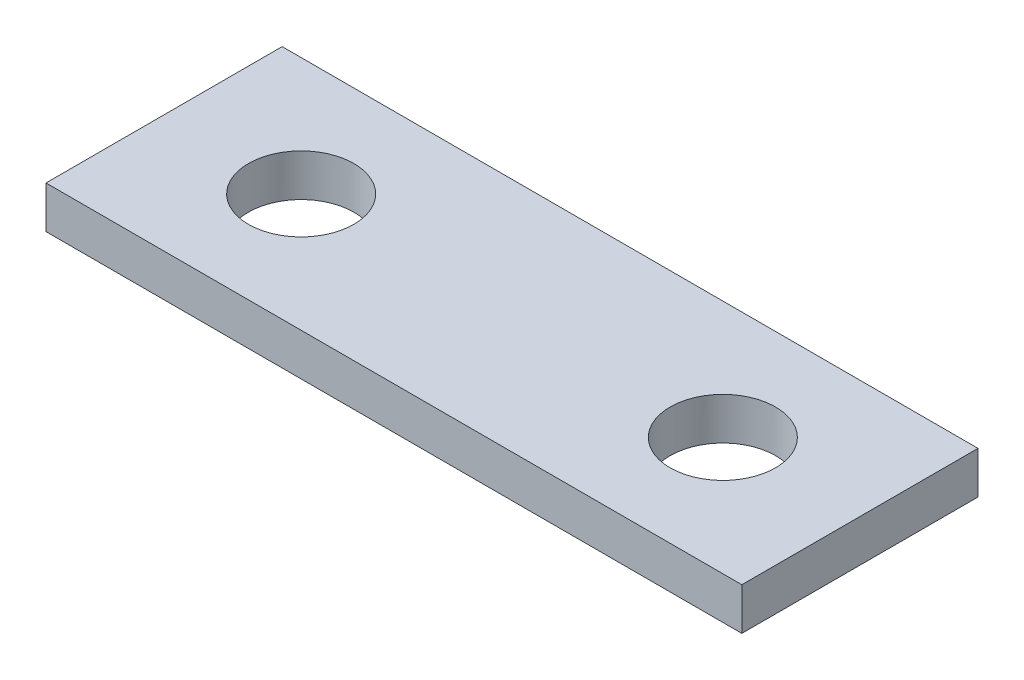
ISO-10303-21;
HEADER;
FILE_DESCRIPTION(('STEP AP214'),'2;1');
FILE_NAME('part.step','',(''),(''),'','','');
FILE_SCHEMA(('AUTOMOTIVE_DESIGN { 1 0 10303 214 1 1 1 1 }'));
ENDSEC;
DATA;
#1=APPLICATION_CONTEXT('core data for automotive mechanical design processes');
#2=APPLICATION_PROTOCOL_DEFINITION('international standard','automotive_design',2000,#1);
#3=PRODUCT_CONTEXT('',#1,'mechanical');
#4=PRODUCT('Part','Part','',(#3));
#5=PRODUCT_RELATED_PRODUCT_CATEGORY('part','',(#4));
#6=PRODUCT_DEFINITION_FORMATION('','',#4);
#7=PRODUCT_DEFINITION_CONTEXT('part definition',#1,'design');
#8=PRODUCT_DEFINITION('design','',#6,#7);
#9=PRODUCT_DEFINITION_SHAPE('','',#8);
#10=(LENGTH_UNIT() NAMED_UNIT(*) SI_UNIT(.MILLI.,.METRE.));
#11=(NAMED_UNIT(*) PLANE_ANGLE_UNIT() SI_UNIT($,.RADIAN.));
#12=(NAMED_UNIT(*) SI_UNIT($,.STERADIAN.) SOLID_ANGLE_UNIT());
#13=UNCERTAINTY_MEASURE_WITH_UNIT(LENGTH_MEASURE(1.E-05),#10,'distance_accuracy_value','');
#14=(GEOMETRIC_REPRESENTATION_CONTEXT(3) GLOBAL_UNCERTAINTY_ASSIGNED_CONTEXT((#13)) GLOBAL_UNIT_ASSIGNED_CONTEXT((#10,
#11,#12)) REPRESENTATION_CONTEXT('',''));
#15=CARTESIAN_POINT('',(0.,0.,0.));
#16=DIRECTION('',(0.,0.,1.));
#17=DIRECTION('',(1.,0.,0.));
#18=AXIS2_PLACEMENT_3D('',#15,#16,#17);
#19=CARTESIAN_POINT('',(0.,1.,0.));
#20=DIRECTION('',(1.,0.,0.));
#21=DIRECTION('',(0.,0.,-1.));
#22=AXIS2_PLACEMENT_3D('',#19,#20,#21);
#23=PLANE('',#22);
#24=DIRECTION('',(0.,0.,1.));
#25=VECTOR('',#24,1.);
#26=CARTESIAN_POINT('',(0.,0.,0.));
#27=LINE('',#26,#25);
#28=CARTESIAN_POINT('',(0.,0.,-5.6));
#29=VERTEX_POINT('',#28);
#30=CARTESIAN_POINT('',(0.,0.,0.));
#31=VERTEX_POINT('',#30);
#32=EDGE_CURVE('E98',#29,#31,#27,.T.);
#33=ORIENTED_EDGE('',*,*,#32,.T.);
#34=DIRECTION('',(0.,-1.,0.));
#35=VECTOR('',#34,1.);
#36=CARTESIAN_POINT('',(0.,1.,0.));
#37=LINE('',#36,#35);
#38=CARTESIAN_POINT('',(0.,1.,0.));
#39=VERTEX_POINT('',#38);
#40=EDGE_CURVE('E11',#39,#31,#37,.T.);
#41=ORIENTED_EDGE('',*,*,#40,.F.);
#42=DIRECTION('',(0.,0.,1.));
#43=VECTOR('',#42,1.);
#44=CARTESIAN_POINT('',(0.,1.,0.));
#45=LINE('',#44,#43);
#46=CARTESIAN_POINT('',(0.,1.,-5.6));
#47=VERTEX_POINT('',#46);
#48=EDGE_CURVE('E86',#47,#39,#45,.T.);
#49=ORIENTED_EDGE('',*,*,#48,.F.);
#50=DIRECTION('',(0.,-1.,0.));
#51=VECTOR('',#50,1.);
#52=CARTESIAN_POINT('',(0.,1.,-5.6));
#53=LINE('',#52,#51);
#54=EDGE_CURVE('E94',#47,#29,#53,.T.);
#55=ORIENTED_EDGE('',*,*,#54,.T.);
#56=EDGE_LOOP('',(#33,#41,#49,#55));
#57=FACE_BOUND('',#56,.T.);
#58=ADVANCED_FACE('F35',(#57),#23,.F.);
#59=CARTESIAN_POINT('',(0.,1.,0.));
#60=DIRECTION('',(0.,0.,-1.));
#61=DIRECTION('',(-1.,0.,0.));
#62=AXIS2_PLACEMENT_3D('',#59,#60,#61);
#63=PLANE('',#62);
#64=DIRECTION('',(1.,0.,0.));
#65=VECTOR('',#64,1.);
#66=CARTESIAN_POINT('',(0.,0.,0.));
#67=LINE('',#66,#65);
#68=CARTESIAN_POINT('',(16.5,0.,0.));
#69=VERTEX_POINT('',#68);
#70=EDGE_CURVE('E90',#31,#69,#67,.T.);
#71=ORIENTED_EDGE('',*,*,#70,.T.);
#72=DIRECTION('',(0.,-1.,0.));
#73=VECTOR('',#72,1.);
#74=CARTESIAN_POINT('',(16.5,1.,0.));
#75=LINE('',#74,#73);
#76=CARTESIAN_POINT('',(16.5,1.,0.));
#77=VERTEX_POINT('',#76);
#78=EDGE_CURVE('E43',#77,#69,#75,.T.);
#79=ORIENTED_EDGE('',*,*,#78,.F.);
#80=DIRECTION('',(1.,0.,0.));
#81=VECTOR('',#80,1.);
#82=CARTESIAN_POINT('',(0.,1.,0.));
#83=LINE('',#82,#81);
#84=EDGE_CURVE('E81',#39,#77,#83,.T.);
#85=ORIENTED_EDGE('',*,*,#84,.F.);
#86=ORIENTED_EDGE('',*,*,#40,.T.);
#87=EDGE_LOOP('',(#71,#79,#85,#86));
#88=FACE_BOUND('',#87,.T.);
#89=ADVANCED_FACE('F89',(#88),#63,.F.);
#90=CARTESIAN_POINT('',(16.5,1.,0.));
#91=DIRECTION('',(-1.,0.,0.));
#92=DIRECTION('',(0.,0.,1.));
#93=AXIS2_PLACEMENT_3D('',#90,#91,#92);
#94=PLANE('',#93);
#95=DIRECTION('',(0.,0.,-1.));
#96=VECTOR('',#95,1.);
#97=CARTESIAN_POINT('',(16.5,0.,0.));
#98=LINE('',#97,#96);
#99=CARTESIAN_POINT('',(16.5,0.,-5.6));
#100=VERTEX_POINT('',#99);
#101=EDGE_CURVE('E68',#69,#100,#98,.T.);
#102=ORIENTED_EDGE('',*,*,#101,.T.);
#103=DIRECTION('',(0.,-1.,0.));
#104=VECTOR('',#103,1.);
#105=CARTESIAN_POINT('',(16.5,1.,-5.6));
#106=LINE('',#105,#104);
#107=CARTESIAN_POINT('',(16.5,1.,-5.6));
#108=VERTEX_POINT('',#107);
#109=EDGE_CURVE('E91',#108,#100,#106,.T.);
#110=ORIENTED_EDGE('',*,*,#109,.F.);
#111=DIRECTION('',(0.,0.,-1.));
#112=VECTOR('',#111,1.);
#113=CARTESIAN_POINT('',(16.5,1.,0.));
#114=LINE('',#113,#112);
#115=EDGE_CURVE('E84',#77,#108,#114,.T.);
#116=ORIENTED_EDGE('',*,*,#115,.F.);
#117=ORIENTED_EDGE('',*,*,#78,.T.);
#118=EDGE_LOOP('',(#102,#110,#116,#117));
#119=FACE_BOUND('',#118,.T.);
#120=ADVANCED_FACE('F92',(#119),#94,.F.);
#121=CARTESIAN_POINT('',(0.,1.,-5.6));
#122=DIRECTION('',(0.,0.,1.));
#123=DIRECTION('',(1.,0.,0.));
#124=AXIS2_PLACEMENT_3D('',#121,#122,#123);
#125=PLANE('',#124);
#126=DIRECTION('',(-1.,0.,0.));
#127=VECTOR('',#126,1.);
#128=CARTESIAN_POINT('',(0.,0.,-5.6));
#129=LINE('',#128,#127);
#130=EDGE_CURVE('E74',#100,#29,#129,.T.);
#131=ORIENTED_EDGE('',*,*,#130,.T.);
#132=ORIENTED_EDGE('',*,*,#54,.F.);
#133=DIRECTION('',(-1.,0.,0.));
#134=VECTOR('',#133,1.);
#135=CARTESIAN_POINT('',(0.,1.,-5.6));
#136=LINE('',#135,#134);
#137=EDGE_CURVE('E51',#108,#47,#136,.T.);
#138=ORIENTED_EDGE('',*,*,#137,.F.);
#139=ORIENTED_EDGE('',*,*,#109,.T.);
#140=EDGE_LOOP('',(#131,#132,#138,#139));
#141=FACE_BOUND('',#140,.T.);
#142=ADVANCED_FACE('F106',(#141),#125,.F.);
#143=CARTESIAN_POINT('',(0.,1.,-5.6));
#144=DIRECTION('',(0.,-1.,0.));
#145=DIRECTION('',(0.,0.,-1.));
#146=AXIS2_PLACEMENT_3D('',#143,#144,#145);
#147=PLANE('',#146);
#148=CARTESIAN_POINT('',(3.25,1.,-2.8));
#149=DIRECTION('',(0.,1.,0.));
#150=DIRECTION('',(0.,0.,1.));
#151=AXIS2_PLACEMENT_3D('',#148,#149,#150);
#152=CIRCLE('',#151,1.25);
#153=CARTESIAN_POINT('',(3.25,1.,-1.55));
#154=VERTEX_POINT('',#153);
#155=EDGE_CURVE('E120',#154,#154,#152,.T.);
#156=ORIENTED_EDGE('',*,*,#155,.F.);
#157=EDGE_LOOP('',(#156));
#158=FACE_BOUND('',#157,.T.);
#159=CARTESIAN_POINT('',(13.25,1.,-2.8));
#160=DIRECTION('',(0.,1.,0.));
#161=DIRECTION('',(0.,0.,1.));
#162=AXIS2_PLACEMENT_3D('',#159,#160,#161);
#163=CIRCLE('',#162,1.25);
#164=CARTESIAN_POINT('',(13.25,1.,-1.55));
#165=VERTEX_POINT('',#164);
#166=EDGE_CURVE('E114',#165,#165,#163,.T.);
#167=ORIENTED_EDGE('',*,*,#166,.F.);
#168=EDGE_LOOP('',(#167));
#169=FACE_BOUND('',#168,.T.);
#170=ORIENTED_EDGE('',*,*,#48,.T.);
#171=ORIENTED_EDGE('',*,*,#84,.T.);
#172=ORIENTED_EDGE('',*,*,#115,.T.);
#173=ORIENTED_EDGE('',*,*,#137,.T.);
#174=EDGE_LOOP('',(#170,#171,#172,#173));
#175=FACE_BOUND('',#174,.T.);
#176=ADVANCED_FACE('F82',(#158,#169,#175),#147,.F.);
#177=CARTESIAN_POINT('',(0.,0.,-5.6));
#178=DIRECTION('',(0.,-1.,0.));
#179=DIRECTION('',(0.,0.,-1.));
#180=AXIS2_PLACEMENT_3D('',#177,#178,#179);
#181=PLANE('',#180);
#182=CARTESIAN_POINT('',(3.25,0.,-2.8));
#183=DIRECTION('',(0.,-1.,0.));
#184=DIRECTION('',(0.,0.,-1.));
#185=AXIS2_PLACEMENT_3D('',#182,#183,#184);
#186=CIRCLE('',#185,1.25);
#187=CARTESIAN_POINT('',(3.25,0.,-4.05));
#188=VERTEX_POINT('',#187);
#189=EDGE_CURVE('E117',#188,#188,#186,.T.);
#190=ORIENTED_EDGE('',*,*,#189,.F.);
#191=EDGE_LOOP('',(#190));
#192=FACE_BOUND('',#191,.T.);
#193=CARTESIAN_POINT('',(13.25,0.,-2.8));
#194=DIRECTION('',(0.,-1.,0.));
#195=DIRECTION('',(0.,0.,-1.));
#196=AXIS2_PLACEMENT_3D('',#193,#194,#195);
#197=CIRCLE('',#196,1.25);
#198=CARTESIAN_POINT('',(13.25,0.,-4.05));
#199=VERTEX_POINT('',#198);
#200=EDGE_CURVE('E101',#199,#199,#197,.T.);
#201=ORIENTED_EDGE('',*,*,#200,.F.);
#202=EDGE_LOOP('',(#201));
#203=FACE_BOUND('',#202,.T.);
#204=ORIENTED_EDGE('',*,*,#32,.F.);
#205=ORIENTED_EDGE('',*,*,#130,.F.);
#206=ORIENTED_EDGE('',*,*,#101,.F.);
#207=ORIENTED_EDGE('',*,*,#70,.F.);
#208=EDGE_LOOP('',(#204,#205,#206,#207));
#209=FACE_BOUND('',#208,.T.);
#210=ADVANCED_FACE('F109',(#192,#203,#209),#181,.T.);
#211=CARTESIAN_POINT('',(13.25,1.,-2.8));
#212=DIRECTION('',(0.,1.,0.));
#213=DIRECTION('',(0.,0.,1.));
#214=AXIS2_PLACEMENT_3D('',#211,#212,#213);
#215=CYLINDRICAL_SURFACE('',#214,1.25);
#216=ORIENTED_EDGE('',*,*,#166,.T.);
#217=EDGE_LOOP('',(#216));
#218=FACE_BOUND('',#217,.T.);
#219=ORIENTED_EDGE('',*,*,#200,.T.);
#220=EDGE_LOOP('',(#219));
#221=FACE_BOUND('',#220,.T.);
#222=ADVANCED_FACE('F132',(#218,#221),#215,.F.);
#223=CARTESIAN_POINT('',(3.25,1.,-2.8));
#224=DIRECTION('',(0.,1.,0.));
#225=DIRECTION('',(0.,0.,1.));
#226=AXIS2_PLACEMENT_3D('',#223,#224,#225);
#227=CYLINDRICAL_SURFACE('',#226,1.25);
#228=ORIENTED_EDGE('',*,*,#155,.T.);
#229=EDGE_LOOP('',(#228));
#230=FACE_BOUND('',#229,.T.);
#231=ORIENTED_EDGE('',*,*,#189,.T.);
#232=EDGE_LOOP('',(#231));
#233=FACE_BOUND('',#232,.T.);
#234=ADVANCED_FACE('F124',(#230,#233),#227,.F.);
#235=CLOSED_SHELL('',(#58,#89,#120,#142,#176,#210,#222,#234));
#236=MANIFOLD_SOLID_BREP('B2',#235);
#237=ADVANCED_BREP_SHAPE_REPRESENTATION('',(#18,#236),#14);
#238=SHAPE_DEFINITION_REPRESENTATION(#9,#237);
ENDSEC;
END-ISO-10303-21;
